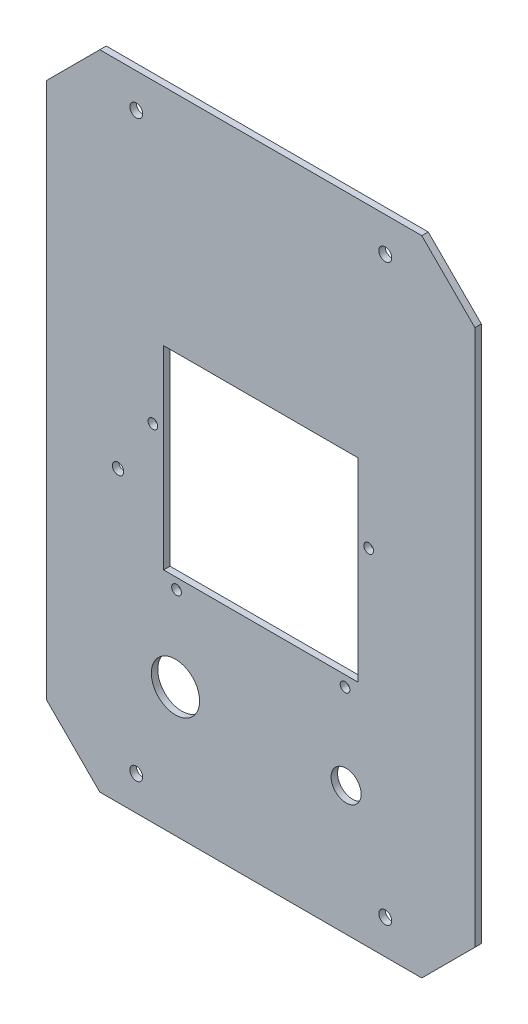
ISO-10303-21;
HEADER;
FILE_DESCRIPTION(('STEP AP214'),'2;1');
FILE_NAME('part.step','',(''),(''),'','','');
FILE_SCHEMA(('AUTOMOTIVE_DESIGN { 1 0 10303 214 1 1 1 1 }'));
ENDSEC;
DATA;
#1=APPLICATION_CONTEXT('core data for automotive mechanical design processes');
#2=APPLICATION_PROTOCOL_DEFINITION('international standard','automotive_design',2000,#1);
#3=PRODUCT_CONTEXT('',#1,'mechanical');
#4=PRODUCT('Part','Part','',(#3));
#5=PRODUCT_RELATED_PRODUCT_CATEGORY('part','',(#4));
#6=PRODUCT_DEFINITION_FORMATION('','',#4);
#7=PRODUCT_DEFINITION_CONTEXT('part definition',#1,'design');
#8=PRODUCT_DEFINITION('design','',#6,#7);
#9=PRODUCT_DEFINITION_SHAPE('','',#8);
#10=(LENGTH_UNIT() NAMED_UNIT(*) SI_UNIT(.MILLI.,.METRE.));
#11=(NAMED_UNIT(*) PLANE_ANGLE_UNIT() SI_UNIT($,.RADIAN.));
#12=(NAMED_UNIT(*) SI_UNIT($,.STERADIAN.) SOLID_ANGLE_UNIT());
#13=UNCERTAINTY_MEASURE_WITH_UNIT(LENGTH_MEASURE(1.E-05),#10,'distance_accuracy_value','');
#14=(GEOMETRIC_REPRESENTATION_CONTEXT(3) GLOBAL_UNCERTAINTY_ASSIGNED_CONTEXT((#13)) GLOBAL_UNIT_ASSIGNED_CONTEXT((#10,
#11,#12)) REPRESENTATION_CONTEXT('',''));
#15=CARTESIAN_POINT('',(0.,0.,0.));
#16=DIRECTION('',(0.,0.,1.));
#17=DIRECTION('',(1.,0.,0.));
#18=AXIS2_PLACEMENT_3D('',#15,#16,#17);
#19=CARTESIAN_POINT('',(0.,0.,3.));
#20=DIRECTION('',(0.707106781186548,-0.707106781186547,0.));
#21=DIRECTION('',(0.707106781186547,0.707106781186548,0.));
#22=AXIS2_PLACEMENT_3D('',#19,#20,#21);
#23=PLANE('',#22);
#24=DIRECTION('',(-0.707106781186547,-0.707106781186548,0.));
#25=VECTOR('',#24,1.);
#26=CARTESIAN_POINT('',(0.,0.,0.));
#27=LINE('',#26,#25);
#28=CARTESIAN_POINT('',(24.7487373415291,24.7487373415292,0.));
#29=VERTEX_POINT('',#28);
#30=CARTESIAN_POINT('',(0.,0.,0.));
#31=VERTEX_POINT('',#30);
#32=EDGE_CURVE('E202',#29,#31,#27,.T.);
#33=ORIENTED_EDGE('',*,*,#32,.F.);
#34=DIRECTION('',(0.,0.,-1.));
#35=VECTOR('',#34,1.);
#36=CARTESIAN_POINT('',(24.7487373415291,24.7487373415292,3.));
#37=LINE('',#36,#35);
#38=CARTESIAN_POINT('',(24.7487373415291,24.7487373415292,3.));
#39=VERTEX_POINT('',#38);
#40=EDGE_CURVE('E11',#39,#29,#37,.T.);
#41=ORIENTED_EDGE('',*,*,#40,.F.);
#42=DIRECTION('',(-0.707106781186547,-0.707106781186548,0.));
#43=VECTOR('',#42,1.);
#44=CARTESIAN_POINT('',(0.,0.,3.));
#45=LINE('',#44,#43);
#46=CARTESIAN_POINT('',(0.,0.,3.));
#47=VERTEX_POINT('',#46);
#48=EDGE_CURVE('E205',#39,#47,#45,.T.);
#49=ORIENTED_EDGE('',*,*,#48,.T.);
#50=DIRECTION('',(0.,0.,-1.));
#51=VECTOR('',#50,1.);
#52=CARTESIAN_POINT('',(0.,0.,3.));
#53=LINE('',#52,#51);
#54=EDGE_CURVE('E230',#47,#31,#53,.T.);
#55=ORIENTED_EDGE('',*,*,#54,.T.);
#56=EDGE_LOOP('',(#33,#41,#49,#55));
#57=FACE_BOUND('',#56,.T.);
#58=ADVANCED_FACE('F39',(#57),#23,.T.);
#59=CARTESIAN_POINT('',(24.7487373415291,0.,3.));
#60=DIRECTION('',(1.,0.,0.));
#61=DIRECTION('',(0.,1.,0.));
#62=AXIS2_PLACEMENT_3D('',#59,#60,#61);
#63=PLANE('',#62);
#64=DIRECTION('',(0.,-1.,0.));
#65=VECTOR('',#64,1.);
#66=CARTESIAN_POINT('',(24.7487373415291,0.,0.));
#67=LINE('',#66,#65);
#68=CARTESIAN_POINT('',(24.748737341529,274.748737341529,0.));
#69=VERTEX_POINT('',#68);
#70=EDGE_CURVE('E233',#69,#29,#67,.T.);
#71=ORIENTED_EDGE('',*,*,#70,.F.);
#72=DIRECTION('',(0.,0.,-1.));
#73=VECTOR('',#72,1.);
#74=CARTESIAN_POINT('',(24.748737341529,274.748737341529,3.));
#75=LINE('',#74,#73);
#76=CARTESIAN_POINT('',(24.748737341529,274.748737341529,3.));
#77=VERTEX_POINT('',#76);
#78=EDGE_CURVE('E46',#77,#69,#75,.T.);
#79=ORIENTED_EDGE('',*,*,#78,.F.);
#80=DIRECTION('',(0.,-1.,0.));
#81=VECTOR('',#80,1.);
#82=CARTESIAN_POINT('',(24.7487373415291,0.,3.));
#83=LINE('',#82,#81);
#84=EDGE_CURVE('E208',#77,#39,#83,.T.);
#85=ORIENTED_EDGE('',*,*,#84,.T.);
#86=ORIENTED_EDGE('',*,*,#40,.T.);
#87=EDGE_LOOP('',(#71,#79,#85,#86));
#88=FACE_BOUND('',#87,.T.);
#89=ADVANCED_FACE('F270',(#88),#63,.T.);
#90=CARTESIAN_POINT('',(149.748737341529,149.748737341529,3.));
#91=DIRECTION('',(0.707106781186547,0.707106781186548,0.));
#92=DIRECTION('',(-0.707106781186548,0.707106781186547,0.));
#93=AXIS2_PLACEMENT_3D('',#90,#91,#92);
#94=PLANE('',#93);
#95=DIRECTION('',(0.707106781186548,-0.707106781186547,0.));
#96=VECTOR('',#95,1.);
#97=CARTESIAN_POINT('',(149.748737341529,149.748737341529,0.));
#98=LINE('',#97,#96);
#99=CARTESIAN_POINT('',(0.,299.497474683058,0.));
#100=VERTEX_POINT('',#99);
#101=EDGE_CURVE('E236',#100,#69,#98,.T.);
#102=ORIENTED_EDGE('',*,*,#101,.F.);
#103=DIRECTION('',(0.,0.,-1.));
#104=VECTOR('',#103,1.);
#105=CARTESIAN_POINT('',(0.,299.497474683058,3.));
#106=LINE('',#105,#104);
#107=CARTESIAN_POINT('',(0.,299.497474683058,3.));
#108=VERTEX_POINT('',#107);
#109=EDGE_CURVE('E262',#108,#100,#106,.T.);
#110=ORIENTED_EDGE('',*,*,#109,.F.);
#111=DIRECTION('',(0.707106781186548,-0.707106781186547,0.));
#112=VECTOR('',#111,1.);
#113=CARTESIAN_POINT('',(149.748737341529,149.748737341529,3.));
#114=LINE('',#113,#112);
#115=EDGE_CURVE('E212',#108,#77,#114,.T.);
#116=ORIENTED_EDGE('',*,*,#115,.T.);
#117=ORIENTED_EDGE('',*,*,#78,.T.);
#118=EDGE_LOOP('',(#102,#110,#116,#117));
#119=FACE_BOUND('',#118,.T.);
#120=ADVANCED_FACE('F266',(#119),#94,.T.);
#121=CARTESIAN_POINT('',(0.,299.497474683058,3.));
#122=DIRECTION('',(0.,1.,0.));
#123=DIRECTION('',(0.,0.,1.));
#124=AXIS2_PLACEMENT_3D('',#121,#122,#123);
#125=PLANE('',#124);
#126=DIRECTION('',(1.,0.,0.));
#127=VECTOR('',#126,1.);
#128=CARTESIAN_POINT('',(0.,299.497474683058,0.));
#129=LINE('',#128,#127);
#130=CARTESIAN_POINT('',(-150.,299.497474683058,0.));
#131=VERTEX_POINT('',#130);
#132=EDGE_CURVE('E239',#131,#100,#129,.T.);
#133=ORIENTED_EDGE('',*,*,#132,.F.);
#134=DIRECTION('',(0.,0.,-1.));
#135=VECTOR('',#134,1.);
#136=CARTESIAN_POINT('',(-150.,299.497474683058,3.));
#137=LINE('',#136,#135);
#138=CARTESIAN_POINT('',(-150.,299.497474683058,3.));
#139=VERTEX_POINT('',#138);
#140=EDGE_CURVE('E260',#139,#131,#137,.T.);
#141=ORIENTED_EDGE('',*,*,#140,.F.);
#142=DIRECTION('',(1.,0.,0.));
#143=VECTOR('',#142,1.);
#144=CARTESIAN_POINT('',(0.,299.497474683058,3.));
#145=LINE('',#144,#143);
#146=EDGE_CURVE('E215',#139,#108,#145,.T.);
#147=ORIENTED_EDGE('',*,*,#146,.T.);
#148=ORIENTED_EDGE('',*,*,#109,.T.);
#149=EDGE_LOOP('',(#133,#141,#147,#148));
#150=FACE_BOUND('',#149,.T.);
#151=ADVANCED_FACE('F276',(#150),#125,.T.);
#152=CARTESIAN_POINT('',(-224.748737341529,224.748737341529,3.));
#153=DIRECTION('',(-0.707106781186547,0.707106781186547,0.));
#154=DIRECTION('',(-0.707106781186548,-0.707106781186548,0.));
#155=AXIS2_PLACEMENT_3D('',#152,#153,#154);
#156=PLANE('',#155);
#157=DIRECTION('',(0.707106781186548,0.707106781186548,0.));
#158=VECTOR('',#157,1.);
#159=CARTESIAN_POINT('',(-224.748737341529,224.748737341529,0.));
#160=LINE('',#159,#158);
#161=CARTESIAN_POINT('',(-174.748737341529,274.748737341529,0.));
#162=VERTEX_POINT('',#161);
#163=EDGE_CURVE('E242',#162,#131,#160,.T.);
#164=ORIENTED_EDGE('',*,*,#163,.F.);
#165=DIRECTION('',(0.,0.,-1.));
#166=VECTOR('',#165,1.);
#167=CARTESIAN_POINT('',(-174.748737341529,274.748737341529,3.));
#168=LINE('',#167,#166);
#169=CARTESIAN_POINT('',(-174.748737341529,274.748737341529,3.));
#170=VERTEX_POINT('',#169);
#171=EDGE_CURVE('E258',#170,#162,#168,.T.);
#172=ORIENTED_EDGE('',*,*,#171,.F.);
#173=DIRECTION('',(0.707106781186548,0.707106781186548,0.));
#174=VECTOR('',#173,1.);
#175=CARTESIAN_POINT('',(-224.748737341529,224.748737341529,3.));
#176=LINE('',#175,#174);
#177=EDGE_CURVE('E218',#170,#139,#176,.T.);
#178=ORIENTED_EDGE('',*,*,#177,.T.);
#179=ORIENTED_EDGE('',*,*,#140,.T.);
#180=EDGE_LOOP('',(#164,#172,#178,#179));
#181=FACE_BOUND('',#180,.T.);
#182=ADVANCED_FACE('F296',(#181),#156,.T.);
#183=CARTESIAN_POINT('',(-174.748737341529,0.,3.));
#184=DIRECTION('',(-1.,0.,0.));
#185=DIRECTION('',(0.,0.,1.));
#186=AXIS2_PLACEMENT_3D('',#183,#184,#185);
#187=PLANE('',#186);
#188=DIRECTION('',(0.,1.,0.));
#189=VECTOR('',#188,1.);
#190=CARTESIAN_POINT('',(-174.748737341529,0.,0.));
#191=LINE('',#190,#189);
#192=CARTESIAN_POINT('',(-174.748737341529,24.7487373415291,0.));
#193=VERTEX_POINT('',#192);
#194=EDGE_CURVE('E245',#193,#162,#191,.T.);
#195=ORIENTED_EDGE('',*,*,#194,.F.);
#196=DIRECTION('',(0.,0.,-1.));
#197=VECTOR('',#196,1.);
#198=CARTESIAN_POINT('',(-174.748737341529,24.7487373415291,3.));
#199=LINE('',#198,#197);
#200=CARTESIAN_POINT('',(-174.748737341529,24.7487373415291,3.));
#201=VERTEX_POINT('',#200);
#202=EDGE_CURVE('E256',#201,#193,#199,.T.);
#203=ORIENTED_EDGE('',*,*,#202,.F.);
#204=DIRECTION('',(0.,1.,0.));
#205=VECTOR('',#204,1.);
#206=CARTESIAN_POINT('',(-174.748737341529,0.,3.));
#207=LINE('',#206,#205);
#208=EDGE_CURVE('E221',#201,#170,#207,.T.);
#209=ORIENTED_EDGE('',*,*,#208,.T.);
#210=ORIENTED_EDGE('',*,*,#171,.T.);
#211=EDGE_LOOP('',(#195,#203,#209,#210));
#212=FACE_BOUND('',#211,.T.);
#213=ADVANCED_FACE('F293',(#212),#187,.T.);
#214=CARTESIAN_POINT('',(-74.9999999999999,-75.,3.));
#215=DIRECTION('',(-0.707106781186547,-0.707106781186548,0.));
#216=DIRECTION('',(0.707106781186548,-0.707106781186547,0.));
#217=AXIS2_PLACEMENT_3D('',#214,#215,#216);
#218=PLANE('',#217);
#219=DIRECTION('',(-0.707106781186548,0.707106781186547,0.));
#220=VECTOR('',#219,1.);
#221=CARTESIAN_POINT('',(-74.9999999999999,-75.,0.));
#222=LINE('',#221,#220);
#223=CARTESIAN_POINT('',(-150.,0.,0.));
#224=VERTEX_POINT('',#223);
#225=EDGE_CURVE('E248',#224,#193,#222,.T.);
#226=ORIENTED_EDGE('',*,*,#225,.F.);
#227=DIRECTION('',(0.,0.,-1.));
#228=VECTOR('',#227,1.);
#229=CARTESIAN_POINT('',(-150.,0.,3.));
#230=LINE('',#229,#228);
#231=CARTESIAN_POINT('',(-150.,0.,3.));
#232=VERTEX_POINT('',#231);
#233=EDGE_CURVE('E254',#232,#224,#230,.T.);
#234=ORIENTED_EDGE('',*,*,#233,.F.);
#235=DIRECTION('',(-0.707106781186548,0.707106781186547,0.));
#236=VECTOR('',#235,1.);
#237=CARTESIAN_POINT('',(-74.9999999999999,-75.,3.));
#238=LINE('',#237,#236);
#239=EDGE_CURVE('E224',#232,#201,#238,.T.);
#240=ORIENTED_EDGE('',*,*,#239,.T.);
#241=ORIENTED_EDGE('',*,*,#202,.T.);
#242=EDGE_LOOP('',(#226,#234,#240,#241));
#243=FACE_BOUND('',#242,.T.);
#244=ADVANCED_FACE('F290',(#243),#218,.T.);
#245=CARTESIAN_POINT('',(0.,0.,3.));
#246=DIRECTION('',(0.,-1.,0.));
#247=DIRECTION('',(0.,0.,-1.));
#248=AXIS2_PLACEMENT_3D('',#245,#246,#247);
#249=PLANE('',#248);
#250=DIRECTION('',(-1.,0.,0.));
#251=VECTOR('',#250,1.);
#252=CARTESIAN_POINT('',(0.,0.,0.));
#253=LINE('',#252,#251);
#254=EDGE_CURVE('E209',#31,#224,#253,.T.);
#255=ORIENTED_EDGE('',*,*,#254,.F.);
#256=ORIENTED_EDGE('',*,*,#54,.F.);
#257=DIRECTION('',(-1.,0.,0.));
#258=VECTOR('',#257,1.);
#259=CARTESIAN_POINT('',(0.,0.,3.));
#260=LINE('',#259,#258);
#261=EDGE_CURVE('E227',#47,#232,#260,.T.);
#262=ORIENTED_EDGE('',*,*,#261,.T.);
#263=ORIENTED_EDGE('',*,*,#233,.T.);
#264=EDGE_LOOP('',(#255,#256,#262,#263));
#265=FACE_BOUND('',#264,.T.);
#266=ADVANCED_FACE('F287',(#265),#249,.T.);
#267=CARTESIAN_POINT('',(0.,0.,3.));
#268=DIRECTION('',(0.,0.,1.));
#269=DIRECTION('',(1.,0.,0.));
#270=AXIS2_PLACEMENT_3D('',#267,#268,#269);
#271=PLANE('',#270);
#272=CARTESIAN_POINT('',(-125.25,160.998737341529,3.));
#273=DIRECTION('',(0.,0.,1.));
#274=DIRECTION('',(1.,0.,0.));
#275=AXIS2_PLACEMENT_3D('',#272,#273,#274);
#276=CIRCLE('',#275,2.25000000000001);
#277=CARTESIAN_POINT('',(-123.,160.998737341529,3.));
#278=VERTEX_POINT('',#277);
#279=EDGE_CURVE('E513',#278,#278,#276,.T.);
#280=ORIENTED_EDGE('',*,*,#279,.F.);
#281=EDGE_LOOP('',(#280));
#282=FACE_BOUND('',#281,.T.);
#283=CARTESIAN_POINT('',(-114.25,99.4987373415291,3.));
#284=DIRECTION('',(0.,0.,1.));
#285=DIRECTION('',(1.,0.,0.));
#286=AXIS2_PLACEMENT_3D('',#283,#284,#285);
#287=CIRCLE('',#286,2.25);
#288=CARTESIAN_POINT('',(-112.,99.4987373415291,3.));
#289=VERTEX_POINT('',#288);
#290=EDGE_CURVE('E534',#289,#289,#287,.T.);
#291=ORIENTED_EDGE('',*,*,#290,.F.);
#292=EDGE_LOOP('',(#291));
#293=FACE_BOUND('',#292,.T.);
#294=CARTESIAN_POINT('',(-35.75,99.4987373415291,3.));
#295=DIRECTION('',(0.,0.,1.));
#296=DIRECTION('',(1.,0.,0.));
#297=AXIS2_PLACEMENT_3D('',#294,#295,#296);
#298=CIRCLE('',#297,2.25);
#299=CARTESIAN_POINT('',(-33.5,99.4987373415291,3.));
#300=VERTEX_POINT('',#299);
#301=EDGE_CURVE('E521',#300,#300,#298,.T.);
#302=ORIENTED_EDGE('',*,*,#301,.F.);
#303=EDGE_LOOP('',(#302));
#304=FACE_BOUND('',#303,.T.);
#305=CARTESIAN_POINT('',(-24.75,160.998737341529,3.));
#306=DIRECTION('',(0.,0.,1.));
#307=DIRECTION('',(1.,0.,0.));
#308=AXIS2_PLACEMENT_3D('',#305,#306,#307);
#309=CIRCLE('',#308,2.25);
#310=CARTESIAN_POINT('',(-22.5,160.998737341529,3.));
#311=VERTEX_POINT('',#310);
#312=EDGE_CURVE('E517',#311,#311,#309,.T.);
#313=ORIENTED_EDGE('',*,*,#312,.F.);
#314=EDGE_LOOP('',(#313));
#315=FACE_BOUND('',#314,.T.);
#316=DIRECTION('',(0.,-1.,0.));
#317=VECTOR('',#316,1.);
#318=CARTESIAN_POINT('',(-120.25,194.998737341529,3.));
#319=LINE('',#318,#317);
#320=CARTESIAN_POINT('',(-120.25,194.998737341529,3.));
#321=VERTEX_POINT('',#320);
#322=CARTESIAN_POINT('',(-120.25,104.498737341529,3.));
#323=VERTEX_POINT('',#322);
#324=EDGE_CURVE('E53',#321,#323,#319,.T.);
#325=ORIENTED_EDGE('',*,*,#324,.F.);
#326=DIRECTION('',(-1.,0.,0.));
#327=VECTOR('',#326,1.);
#328=CARTESIAN_POINT('',(-120.25,194.998737341529,3.));
#329=LINE('',#328,#327);
#330=CARTESIAN_POINT('',(-29.75,194.998737341529,3.));
#331=VERTEX_POINT('',#330);
#332=EDGE_CURVE('E134',#331,#321,#329,.T.);
#333=ORIENTED_EDGE('',*,*,#332,.F.);
#334=DIRECTION('',(0.,1.,0.));
#335=VECTOR('',#334,1.);
#336=CARTESIAN_POINT('',(-29.75,194.998737341529,3.));
#337=LINE('',#336,#335);
#338=CARTESIAN_POINT('',(-29.75,104.498737341529,3.));
#339=VERTEX_POINT('',#338);
#340=EDGE_CURVE('E154',#339,#331,#337,.T.);
#341=ORIENTED_EDGE('',*,*,#340,.F.);
#342=DIRECTION('',(1.,0.,0.));
#343=VECTOR('',#342,1.);
#344=CARTESIAN_POINT('',(-120.25,104.498737341529,3.));
#345=LINE('',#344,#343);
#346=EDGE_CURVE('E148',#323,#339,#345,.T.);
#347=ORIENTED_EDGE('',*,*,#346,.F.);
#348=EDGE_LOOP('',(#325,#333,#341,#347));
#349=FACE_BOUND('',#348,.T.);
#350=CARTESIAN_POINT('',(-141.498737341529,134.75,3.));
#351=DIRECTION('',(0.,0.,1.));
#352=DIRECTION('',(1.,0.,0.));
#353=AXIS2_PLACEMENT_3D('',#350,#351,#352);
#354=CIRCLE('',#353,2.625);
#355=CARTESIAN_POINT('',(-138.873737341529,134.75,3.));
#356=VERTEX_POINT('',#355);
#357=EDGE_CURVE('E140',#356,#356,#354,.F.);
#358=ORIENTED_EDGE('',*,*,#357,.T.);
#359=EDGE_LOOP('',(#358));
#360=FACE_BOUND('',#359,.T.);
#361=CARTESIAN_POINT('',(-114.748737341529,60.,3.));
#362=DIRECTION('',(0.,0.,1.));
#363=DIRECTION('',(1.,0.,0.));
#364=AXIS2_PLACEMENT_3D('',#361,#362,#363);
#365=CIRCLE('',#364,11.25);
#366=CARTESIAN_POINT('',(-103.498737341529,60.,3.));
#367=VERTEX_POINT('',#366);
#368=EDGE_CURVE('E173',#367,#367,#365,.F.);
#369=ORIENTED_EDGE('',*,*,#368,.T.);
#370=EDGE_LOOP('',(#369));
#371=FACE_BOUND('',#370,.T.);
#372=CARTESIAN_POINT('',(-35.2512626584709,60.,3.));
#373=DIRECTION('',(0.,0.,1.));
#374=DIRECTION('',(1.,0.,0.));
#375=AXIS2_PLACEMENT_3D('',#372,#373,#374);
#376=CIRCLE('',#375,7.);
#377=CARTESIAN_POINT('',(-28.2512626584709,60.,3.));
#378=VERTEX_POINT('',#377);
#379=EDGE_CURVE('E166',#378,#378,#376,.F.);
#380=ORIENTED_EDGE('',*,*,#379,.T.);
#381=EDGE_LOOP('',(#380));
#382=FACE_BOUND('',#381,.T.);
#383=CARTESIAN_POINT('',(-17.0012626584709,283.497474683058,3.));
#384=DIRECTION('',(0.,0.,-1.));
#385=DIRECTION('',(1.,0.,0.));
#386=AXIS2_PLACEMENT_3D('',#383,#384,#385);
#387=CIRCLE('',#386,2.99999999999999);
#388=CARTESIAN_POINT('',(-14.0012626584709,283.497474683058,3.));
#389=VERTEX_POINT('',#388);
#390=EDGE_CURVE('E194',#389,#389,#387,.T.);
#391=ORIENTED_EDGE('',*,*,#390,.T.);
#392=EDGE_LOOP('',(#391));
#393=FACE_BOUND('',#392,.T.);
#394=CARTESIAN_POINT('',(-17.0012626584708,16.,3.));
#395=DIRECTION('',(0.,0.,-1.));
#396=DIRECTION('',(-1.,0.,0.));
#397=AXIS2_PLACEMENT_3D('',#394,#395,#396);
#398=CIRCLE('',#397,2.99999999999999);
#399=CARTESIAN_POINT('',(-20.0012626584708,16.,3.));
#400=VERTEX_POINT('',#399);
#401=EDGE_CURVE('E188',#400,#400,#398,.T.);
#402=ORIENTED_EDGE('',*,*,#401,.T.);
#403=EDGE_LOOP('',(#402));
#404=FACE_BOUND('',#403,.T.);
#405=CARTESIAN_POINT('',(-132.998737341529,16.,3.));
#406=DIRECTION('',(0.,0.,-1.));
#407=DIRECTION('',(1.,0.,0.));
#408=AXIS2_PLACEMENT_3D('',#405,#406,#407);
#409=CIRCLE('',#408,2.99999999999999);
#410=CARTESIAN_POINT('',(-129.998737341529,16.,3.));
#411=VERTEX_POINT('',#410);
#412=EDGE_CURVE('E181',#411,#411,#409,.T.);
#413=ORIENTED_EDGE('',*,*,#412,.T.);
#414=EDGE_LOOP('',(#413));
#415=FACE_BOUND('',#414,.T.);
#416=CARTESIAN_POINT('',(-132.998737341529,283.497474683058,3.));
#417=DIRECTION('',(0.,0.,-1.));
#418=DIRECTION('',(-1.,0.,0.));
#419=AXIS2_PLACEMENT_3D('',#416,#417,#418);
#420=CIRCLE('',#419,2.99999999999999);
#421=CARTESIAN_POINT('',(-135.998737341529,283.497474683058,3.));
#422=VERTEX_POINT('',#421);
#423=EDGE_CURVE('E199',#422,#422,#420,.T.);
#424=ORIENTED_EDGE('',*,*,#423,.T.);
#425=EDGE_LOOP('',(#424));
#426=FACE_BOUND('',#425,.T.);
#427=ORIENTED_EDGE('',*,*,#48,.F.);
#428=ORIENTED_EDGE('',*,*,#84,.F.);
#429=ORIENTED_EDGE('',*,*,#115,.F.);
#430=ORIENTED_EDGE('',*,*,#146,.F.);
#431=ORIENTED_EDGE('',*,*,#177,.F.);
#432=ORIENTED_EDGE('',*,*,#208,.F.);
#433=ORIENTED_EDGE('',*,*,#239,.F.);
#434=ORIENTED_EDGE('',*,*,#261,.F.);
#435=EDGE_LOOP('',(#427,#428,#429,#430,#431,#432,#433,#434));
#436=FACE_BOUND('',#435,.T.);
#437=ADVANCED_FACE('F280',(#282,#293,#304,#315,#349,#360,#371,#382,#393,#404,#415,#426,#436),
#271,.T.);
#438=CARTESIAN_POINT('',(0.,0.,0.));
#439=DIRECTION('',(0.,0.,1.));
#440=DIRECTION('',(1.,0.,0.));
#441=AXIS2_PLACEMENT_3D('',#438,#439,#440);
#442=PLANE('',#441);
#443=CARTESIAN_POINT('',(-125.25,160.998737341529,0.));
#444=DIRECTION('',(0.,0.,-1.));
#445=DIRECTION('',(-1.,0.,0.));
#446=AXIS2_PLACEMENT_3D('',#443,#444,#445);
#447=CIRCLE('',#446,2.25000000000001);
#448=CARTESIAN_POINT('',(-127.5,160.998737341529,0.));
#449=VERTEX_POINT('',#448);
#450=EDGE_CURVE('E516',#449,#449,#447,.T.);
#451=ORIENTED_EDGE('',*,*,#450,.F.);
#452=EDGE_LOOP('',(#451));
#453=FACE_BOUND('',#452,.T.);
#454=CARTESIAN_POINT('',(-114.25,99.4987373415291,0.));
#455=DIRECTION('',(0.,0.,-1.));
#456=DIRECTION('',(-1.,0.,0.));
#457=AXIS2_PLACEMENT_3D('',#454,#455,#456);
#458=CIRCLE('',#457,2.25);
#459=CARTESIAN_POINT('',(-116.5,99.4987373415291,0.));
#460=VERTEX_POINT('',#459);
#461=EDGE_CURVE('E518',#460,#460,#458,.T.);
#462=ORIENTED_EDGE('',*,*,#461,.F.);
#463=EDGE_LOOP('',(#462));
#464=FACE_BOUND('',#463,.T.);
#465=CARTESIAN_POINT('',(-35.75,99.4987373415291,0.));
#466=DIRECTION('',(0.,0.,-1.));
#467=DIRECTION('',(-1.,0.,0.));
#468=AXIS2_PLACEMENT_3D('',#465,#466,#467);
#469=CIRCLE('',#468,2.25);
#470=CARTESIAN_POINT('',(-38.,99.4987373415291,0.));
#471=VERTEX_POINT('',#470);
#472=EDGE_CURVE('E524',#471,#471,#469,.T.);
#473=ORIENTED_EDGE('',*,*,#472,.F.);
#474=EDGE_LOOP('',(#473));
#475=FACE_BOUND('',#474,.T.);
#476=CARTESIAN_POINT('',(-24.75,160.998737341529,0.));
#477=DIRECTION('',(0.,0.,-1.));
#478=DIRECTION('',(-1.,0.,0.));
#479=AXIS2_PLACEMENT_3D('',#476,#477,#478);
#480=CIRCLE('',#479,2.25);
#481=CARTESIAN_POINT('',(-27.,160.998737341529,0.));
#482=VERTEX_POINT('',#481);
#483=EDGE_CURVE('E529',#482,#482,#480,.T.);
#484=ORIENTED_EDGE('',*,*,#483,.F.);
#485=EDGE_LOOP('',(#484));
#486=FACE_BOUND('',#485,.T.);
#487=DIRECTION('',(1.,0.,0.));
#488=VECTOR('',#487,1.);
#489=CARTESIAN_POINT('',(-120.25,194.998737341529,0.));
#490=LINE('',#489,#488);
#491=CARTESIAN_POINT('',(-120.25,194.998737341529,0.));
#492=VERTEX_POINT('',#491);
#493=CARTESIAN_POINT('',(-29.75,194.998737341529,0.));
#494=VERTEX_POINT('',#493);
#495=EDGE_CURVE('E146',#492,#494,#490,.T.);
#496=ORIENTED_EDGE('',*,*,#495,.F.);
#497=DIRECTION('',(0.,1.,0.));
#498=VECTOR('',#497,1.);
#499=CARTESIAN_POINT('',(-120.25,194.998737341529,0.));
#500=LINE('',#499,#498);
#501=CARTESIAN_POINT('',(-120.25,104.498737341529,0.));
#502=VERTEX_POINT('',#501);
#503=EDGE_CURVE('E128',#502,#492,#500,.T.);
#504=ORIENTED_EDGE('',*,*,#503,.F.);
#505=DIRECTION('',(-1.,0.,0.));
#506=VECTOR('',#505,1.);
#507=CARTESIAN_POINT('',(-120.25,104.498737341529,0.));
#508=LINE('',#507,#506);
#509=CARTESIAN_POINT('',(-29.75,104.498737341529,0.));
#510=VERTEX_POINT('',#509);
#511=EDGE_CURVE('E137',#510,#502,#508,.T.);
#512=ORIENTED_EDGE('',*,*,#511,.F.);
#513=DIRECTION('',(0.,-1.,0.));
#514=VECTOR('',#513,1.);
#515=CARTESIAN_POINT('',(-29.75,194.998737341529,0.));
#516=LINE('',#515,#514);
#517=EDGE_CURVE('E61',#494,#510,#516,.T.);
#518=ORIENTED_EDGE('',*,*,#517,.F.);
#519=EDGE_LOOP('',(#496,#504,#512,#518));
#520=FACE_BOUND('',#519,.T.);
#521=CARTESIAN_POINT('',(-141.498737341529,134.75,0.));
#522=DIRECTION('',(0.,0.,-1.));
#523=DIRECTION('',(-1.,0.,0.));
#524=AXIS2_PLACEMENT_3D('',#521,#522,#523);
#525=CIRCLE('',#524,2.625);
#526=CARTESIAN_POINT('',(-144.123737341529,134.75,0.));
#527=VERTEX_POINT('',#526);
#528=EDGE_CURVE('E163',#527,#527,#525,.T.);
#529=ORIENTED_EDGE('',*,*,#528,.F.);
#530=EDGE_LOOP('',(#529));
#531=FACE_BOUND('',#530,.T.);
#532=CARTESIAN_POINT('',(-114.748737341529,60.,0.));
#533=DIRECTION('',(0.,0.,-1.));
#534=DIRECTION('',(-1.,0.,0.));
#535=AXIS2_PLACEMENT_3D('',#532,#533,#534);
#536=CIRCLE('',#535,11.25);
#537=CARTESIAN_POINT('',(-125.998737341529,60.,0.));
#538=VERTEX_POINT('',#537);
#539=EDGE_CURVE('E169',#538,#538,#536,.T.);
#540=ORIENTED_EDGE('',*,*,#539,.F.);
#541=EDGE_LOOP('',(#540));
#542=FACE_BOUND('',#541,.T.);
#543=CARTESIAN_POINT('',(-35.2512626584709,60.,0.));
#544=DIRECTION('',(0.,0.,-1.));
#545=DIRECTION('',(-1.,0.,0.));
#546=AXIS2_PLACEMENT_3D('',#543,#544,#545);
#547=CIRCLE('',#546,7.);
#548=CARTESIAN_POINT('',(-42.2512626584709,60.,0.));
#549=VERTEX_POINT('',#548);
#550=EDGE_CURVE('E176',#549,#549,#547,.T.);
#551=ORIENTED_EDGE('',*,*,#550,.F.);
#552=EDGE_LOOP('',(#551));
#553=FACE_BOUND('',#552,.T.);
#554=CARTESIAN_POINT('',(-17.0012626584709,283.497474683058,0.));
#555=DIRECTION('',(0.,0.,-1.));
#556=DIRECTION('',(1.,0.,0.));
#557=AXIS2_PLACEMENT_3D('',#554,#555,#556);
#558=CIRCLE('',#557,2.99999999999999);
#559=CARTESIAN_POINT('',(-14.0012626584709,283.497474683058,0.));
#560=VERTEX_POINT('',#559);
#561=EDGE_CURVE('E172',#560,#560,#558,.T.);
#562=ORIENTED_EDGE('',*,*,#561,.F.);
#563=EDGE_LOOP('',(#562));
#564=FACE_BOUND('',#563,.T.);
#565=CARTESIAN_POINT('',(-17.0012626584708,16.,0.));
#566=DIRECTION('',(0.,0.,-1.));
#567=DIRECTION('',(-1.,0.,0.));
#568=AXIS2_PLACEMENT_3D('',#565,#566,#567);
#569=CIRCLE('',#568,2.99999999999999);
#570=CARTESIAN_POINT('',(-20.0012626584708,16.,0.));
#571=VERTEX_POINT('',#570);
#572=EDGE_CURVE('E191',#571,#571,#569,.T.);
#573=ORIENTED_EDGE('',*,*,#572,.F.);
#574=EDGE_LOOP('',(#573));
#575=FACE_BOUND('',#574,.T.);
#576=CARTESIAN_POINT('',(-132.998737341529,16.,0.));
#577=DIRECTION('',(0.,0.,-1.));
#578=DIRECTION('',(1.,0.,0.));
#579=AXIS2_PLACEMENT_3D('',#576,#577,#578);
#580=CIRCLE('',#579,2.99999999999999);
#581=CARTESIAN_POINT('',(-129.998737341529,16.,0.));
#582=VERTEX_POINT('',#581);
#583=EDGE_CURVE('E185',#582,#582,#580,.T.);
#584=ORIENTED_EDGE('',*,*,#583,.F.);
#585=EDGE_LOOP('',(#584));
#586=FACE_BOUND('',#585,.T.);
#587=CARTESIAN_POINT('',(-132.998737341529,283.497474683058,0.));
#588=DIRECTION('',(0.,0.,-1.));
#589=DIRECTION('',(-1.,0.,0.));
#590=AXIS2_PLACEMENT_3D('',#587,#588,#589);
#591=CIRCLE('',#590,2.99999999999999);
#592=CARTESIAN_POINT('',(-135.998737341529,283.497474683058,0.));
#593=VERTEX_POINT('',#592);
#594=EDGE_CURVE('E184',#593,#593,#591,.T.);
#595=ORIENTED_EDGE('',*,*,#594,.F.);
#596=EDGE_LOOP('',(#595));
#597=FACE_BOUND('',#596,.T.);
#598=ORIENTED_EDGE('',*,*,#32,.T.);
#599=ORIENTED_EDGE('',*,*,#254,.T.);
#600=ORIENTED_EDGE('',*,*,#225,.T.);
#601=ORIENTED_EDGE('',*,*,#194,.T.);
#602=ORIENTED_EDGE('',*,*,#163,.T.);
#603=ORIENTED_EDGE('',*,*,#132,.T.);
#604=ORIENTED_EDGE('',*,*,#101,.T.);
#605=ORIENTED_EDGE('',*,*,#70,.T.);
#606=EDGE_LOOP('',(#598,#599,#600,#601,#602,#603,#604,#605));
#607=FACE_BOUND('',#606,.T.);
#608=ADVANCED_FACE('F143',(#453,#464,#475,#486,#520,#531,#542,#553,#564,#575,#586,#597,#607),
#442,.F.);
#609=CARTESIAN_POINT('',(-132.998737341529,283.497474683058,3.));
#610=DIRECTION('',(0.,0.,-1.));
#611=DIRECTION('',(-1.,0.,0.));
#612=AXIS2_PLACEMENT_3D('',#609,#610,#611);
#613=CYLINDRICAL_SURFACE('',#612,2.99999999999999);
#614=ORIENTED_EDGE('',*,*,#423,.F.);
#615=EDGE_LOOP('',(#614));
#616=FACE_BOUND('',#615,.T.);
#617=ORIENTED_EDGE('',*,*,#594,.T.);
#618=EDGE_LOOP('',(#617));
#619=FACE_BOUND('',#618,.T.);
#620=ADVANCED_FACE('F354',(#616,#619),#613,.F.);
#621=CARTESIAN_POINT('',(-132.998737341529,16.,3.));
#622=DIRECTION('',(0.,0.,-1.));
#623=DIRECTION('',(-1.,0.,0.));
#624=AXIS2_PLACEMENT_3D('',#621,#622,#623);
#625=CYLINDRICAL_SURFACE('',#624,2.99999999999999);
#626=ORIENTED_EDGE('',*,*,#412,.F.);
#627=EDGE_LOOP('',(#626));
#628=FACE_BOUND('',#627,.T.);
#629=ORIENTED_EDGE('',*,*,#583,.T.);
#630=EDGE_LOOP('',(#629));
#631=FACE_BOUND('',#630,.T.);
#632=ADVANCED_FACE('F359',(#628,#631),#625,.F.);
#633=CARTESIAN_POINT('',(-17.0012626584708,16.,3.));
#634=DIRECTION('',(0.,0.,-1.));
#635=DIRECTION('',(-1.,0.,0.));
#636=AXIS2_PLACEMENT_3D('',#633,#634,#635);
#637=CYLINDRICAL_SURFACE('',#636,2.99999999999999);
#638=ORIENTED_EDGE('',*,*,#401,.F.);
#639=EDGE_LOOP('',(#638));
#640=FACE_BOUND('',#639,.T.);
#641=ORIENTED_EDGE('',*,*,#572,.T.);
#642=EDGE_LOOP('',(#641));
#643=FACE_BOUND('',#642,.T.);
#644=ADVANCED_FACE('F371',(#640,#643),#637,.F.);
#645=CARTESIAN_POINT('',(-17.0012626584709,283.497474683058,3.));
#646=DIRECTION('',(0.,0.,-1.));
#647=DIRECTION('',(-1.,0.,0.));
#648=AXIS2_PLACEMENT_3D('',#645,#646,#647);
#649=CYLINDRICAL_SURFACE('',#648,2.99999999999999);
#650=ORIENTED_EDGE('',*,*,#390,.F.);
#651=EDGE_LOOP('',(#650));
#652=FACE_BOUND('',#651,.T.);
#653=ORIENTED_EDGE('',*,*,#561,.T.);
#654=EDGE_LOOP('',(#653));
#655=FACE_BOUND('',#654,.T.);
#656=ADVANCED_FACE('F381',(#652,#655),#649,.F.);
#657=CARTESIAN_POINT('',(-35.2512626584709,60.,3.001));
#658=DIRECTION('',(0.,0.,-1.));
#659=DIRECTION('',(-1.,0.,0.));
#660=AXIS2_PLACEMENT_3D('',#657,#658,#659);
#661=CYLINDRICAL_SURFACE('',#660,7.);
#662=ORIENTED_EDGE('',*,*,#379,.F.);
#663=EDGE_LOOP('',(#662));
#664=FACE_BOUND('',#663,.T.);
#665=ORIENTED_EDGE('',*,*,#550,.T.);
#666=EDGE_LOOP('',(#665));
#667=FACE_BOUND('',#666,.T.);
#668=ADVANCED_FACE('F391',(#664,#667),#661,.F.);
#669=CARTESIAN_POINT('',(-114.748737341529,60.,3.001));
#670=DIRECTION('',(0.,0.,-1.));
#671=DIRECTION('',(-1.,0.,0.));
#672=AXIS2_PLACEMENT_3D('',#669,#670,#671);
#673=CYLINDRICAL_SURFACE('',#672,11.25);
#674=ORIENTED_EDGE('',*,*,#368,.F.);
#675=EDGE_LOOP('',(#674));
#676=FACE_BOUND('',#675,.T.);
#677=ORIENTED_EDGE('',*,*,#539,.T.);
#678=EDGE_LOOP('',(#677));
#679=FACE_BOUND('',#678,.T.);
#680=ADVANCED_FACE('F401',(#676,#679),#673,.F.);
#681=CARTESIAN_POINT('',(-141.498737341529,134.75,3.001));
#682=DIRECTION('',(0.,0.,-1.));
#683=DIRECTION('',(-1.,0.,0.));
#684=AXIS2_PLACEMENT_3D('',#681,#682,#683);
#685=CYLINDRICAL_SURFACE('',#684,2.625);
#686=ORIENTED_EDGE('',*,*,#357,.F.);
#687=EDGE_LOOP('',(#686));
#688=FACE_BOUND('',#687,.T.);
#689=ORIENTED_EDGE('',*,*,#528,.T.);
#690=EDGE_LOOP('',(#689));
#691=FACE_BOUND('',#690,.T.);
#692=ADVANCED_FACE('F411',(#688,#691),#685,.F.);
#693=CARTESIAN_POINT('',(-120.25,194.998737341529,-0.00100000000000013));
#694=DIRECTION('',(-1.,0.,0.));
#695=DIRECTION('',(0.,0.,1.));
#696=AXIS2_PLACEMENT_3D('',#693,#694,#695);
#697=PLANE('',#696);
#698=ORIENTED_EDGE('',*,*,#503,.T.);
#699=DIRECTION('',(0.,0.,1.));
#700=VECTOR('',#699,1.);
#701=CARTESIAN_POINT('',(-120.25,194.998737341529,-0.00100000000000013));
#702=LINE('',#701,#700);
#703=EDGE_CURVE('E141',#492,#321,#702,.T.);
#704=ORIENTED_EDGE('',*,*,#703,.T.);
#705=ORIENTED_EDGE('',*,*,#324,.T.);
#706=DIRECTION('',(0.,0.,1.));
#707=VECTOR('',#706,1.);
#708=CARTESIAN_POINT('',(-120.25,104.498737341529,-0.00100000000000013));
#709=LINE('',#708,#707);
#710=EDGE_CURVE('E124',#502,#323,#709,.T.);
#711=ORIENTED_EDGE('',*,*,#710,.F.);
#712=EDGE_LOOP('',(#698,#704,#705,#711));
#713=FACE_BOUND('',#712,.T.);
#714=ADVANCED_FACE('F126',(#713),#697,.F.);
#715=CARTESIAN_POINT('',(-120.25,194.998737341529,-0.00100000000000013));
#716=DIRECTION('',(0.,1.,0.));
#717=DIRECTION('',(0.,0.,1.));
#718=AXIS2_PLACEMENT_3D('',#715,#716,#717);
#719=PLANE('',#718);
#720=ORIENTED_EDGE('',*,*,#495,.T.);
#721=DIRECTION('',(0.,0.,1.));
#722=VECTOR('',#721,1.);
#723=CARTESIAN_POINT('',(-29.75,194.998737341529,-0.00100000000000013));
#724=LINE('',#723,#722);
#725=EDGE_CURVE('E160',#494,#331,#724,.T.);
#726=ORIENTED_EDGE('',*,*,#725,.T.);
#727=ORIENTED_EDGE('',*,*,#332,.T.);
#728=ORIENTED_EDGE('',*,*,#703,.F.);
#729=EDGE_LOOP('',(#720,#726,#727,#728));
#730=FACE_BOUND('',#729,.T.);
#731=ADVANCED_FACE('F430',(#730),#719,.F.);
#732=CARTESIAN_POINT('',(-29.75,194.998737341529,-0.00100000000000013));
#733=DIRECTION('',(1.,0.,0.));
#734=DIRECTION('',(0.,0.,-1.));
#735=AXIS2_PLACEMENT_3D('',#732,#733,#734);
#736=PLANE('',#735);
#737=ORIENTED_EDGE('',*,*,#517,.T.);
#738=DIRECTION('',(0.,0.,1.));
#739=VECTOR('',#738,1.);
#740=CARTESIAN_POINT('',(-29.75,104.498737341529,-0.00100000000000013));
#741=LINE('',#740,#739);
#742=EDGE_CURVE('E133',#510,#339,#741,.T.);
#743=ORIENTED_EDGE('',*,*,#742,.T.);
#744=ORIENTED_EDGE('',*,*,#340,.T.);
#745=ORIENTED_EDGE('',*,*,#725,.F.);
#746=EDGE_LOOP('',(#737,#743,#744,#745));
#747=FACE_BOUND('',#746,.T.);
#748=ADVANCED_FACE('F439',(#747),#736,.F.);
#749=CARTESIAN_POINT('',(-120.25,104.498737341529,-0.00100000000000013));
#750=DIRECTION('',(0.,-1.,0.));
#751=DIRECTION('',(1.,0.,0.));
#752=AXIS2_PLACEMENT_3D('',#749,#750,#751);
#753=PLANE('',#752);
#754=ORIENTED_EDGE('',*,*,#511,.T.);
#755=ORIENTED_EDGE('',*,*,#710,.T.);
#756=ORIENTED_EDGE('',*,*,#346,.T.);
#757=ORIENTED_EDGE('',*,*,#742,.F.);
#758=EDGE_LOOP('',(#754,#755,#756,#757));
#759=FACE_BOUND('',#758,.T.);
#760=ADVANCED_FACE('F138',(#759),#753,.F.);
#761=CARTESIAN_POINT('',(-24.75,160.998737341529,10.));
#762=DIRECTION('',(0.,0.,-1.));
#763=DIRECTION('',(-1.,0.,0.));
#764=AXIS2_PLACEMENT_3D('',#761,#762,#763);
#765=CYLINDRICAL_SURFACE('',#764,2.25);
#766=ORIENTED_EDGE('',*,*,#312,.T.);
#767=EDGE_LOOP('',(#766));
#768=FACE_BOUND('',#767,.T.);
#769=ORIENTED_EDGE('',*,*,#483,.T.);
#770=EDGE_LOOP('',(#769));
#771=FACE_BOUND('',#770,.T.);
#772=ADVANCED_FACE('F457',(#768,#771),#765,.F.);
#773=CARTESIAN_POINT('',(-35.75,99.4987373415291,10.));
#774=DIRECTION('',(0.,0.,-1.));
#775=DIRECTION('',(-1.,0.,0.));
#776=AXIS2_PLACEMENT_3D('',#773,#774,#775);
#777=CYLINDRICAL_SURFACE('',#776,2.25);
#778=ORIENTED_EDGE('',*,*,#301,.T.);
#779=EDGE_LOOP('',(#778));
#780=FACE_BOUND('',#779,.T.);
#781=ORIENTED_EDGE('',*,*,#472,.T.);
#782=EDGE_LOOP('',(#781));
#783=FACE_BOUND('',#782,.T.);
#784=ADVANCED_FACE('F476',(#780,#783),#777,.F.);
#785=CARTESIAN_POINT('',(-114.25,99.4987373415291,10.));
#786=DIRECTION('',(0.,0.,-1.));
#787=DIRECTION('',(-1.,0.,0.));
#788=AXIS2_PLACEMENT_3D('',#785,#786,#787);
#789=CYLINDRICAL_SURFACE('',#788,2.25);
#790=ORIENTED_EDGE('',*,*,#290,.T.);
#791=EDGE_LOOP('',(#790));
#792=FACE_BOUND('',#791,.T.);
#793=ORIENTED_EDGE('',*,*,#461,.T.);
#794=EDGE_LOOP('',(#793));
#795=FACE_BOUND('',#794,.T.);
#796=ADVANCED_FACE('F486',(#792,#795),#789,.F.);
#797=CARTESIAN_POINT('',(-125.25,160.998737341529,10.));
#798=DIRECTION('',(0.,0.,-1.));
#799=DIRECTION('',(-1.,0.,0.));
#800=AXIS2_PLACEMENT_3D('',#797,#798,#799);
#801=CYLINDRICAL_SURFACE('',#800,2.25000000000001);
#802=ORIENTED_EDGE('',*,*,#279,.T.);
#803=EDGE_LOOP('',(#802));
#804=FACE_BOUND('',#803,.T.);
#805=ORIENTED_EDGE('',*,*,#450,.T.);
#806=EDGE_LOOP('',(#805));
#807=FACE_BOUND('',#806,.T.);
#808=ADVANCED_FACE('F496',(#804,#807),#801,.F.);
#809=CLOSED_SHELL('',(#58,#89,#120,#151,#182,#213,#244,#266,#437,#608,#620,#632,#644,#656,#668,
#680,#692,#714,#731,#748,#760,#772,#784,#796,#808));
#810=MANIFOLD_SOLID_BREP('B2',#809);
#811=ADVANCED_BREP_SHAPE_REPRESENTATION('',(#18,#810),#14);
#812=SHAPE_DEFINITION_REPRESENTATION(#9,#811);
ENDSEC;
END-ISO-10303-21;
